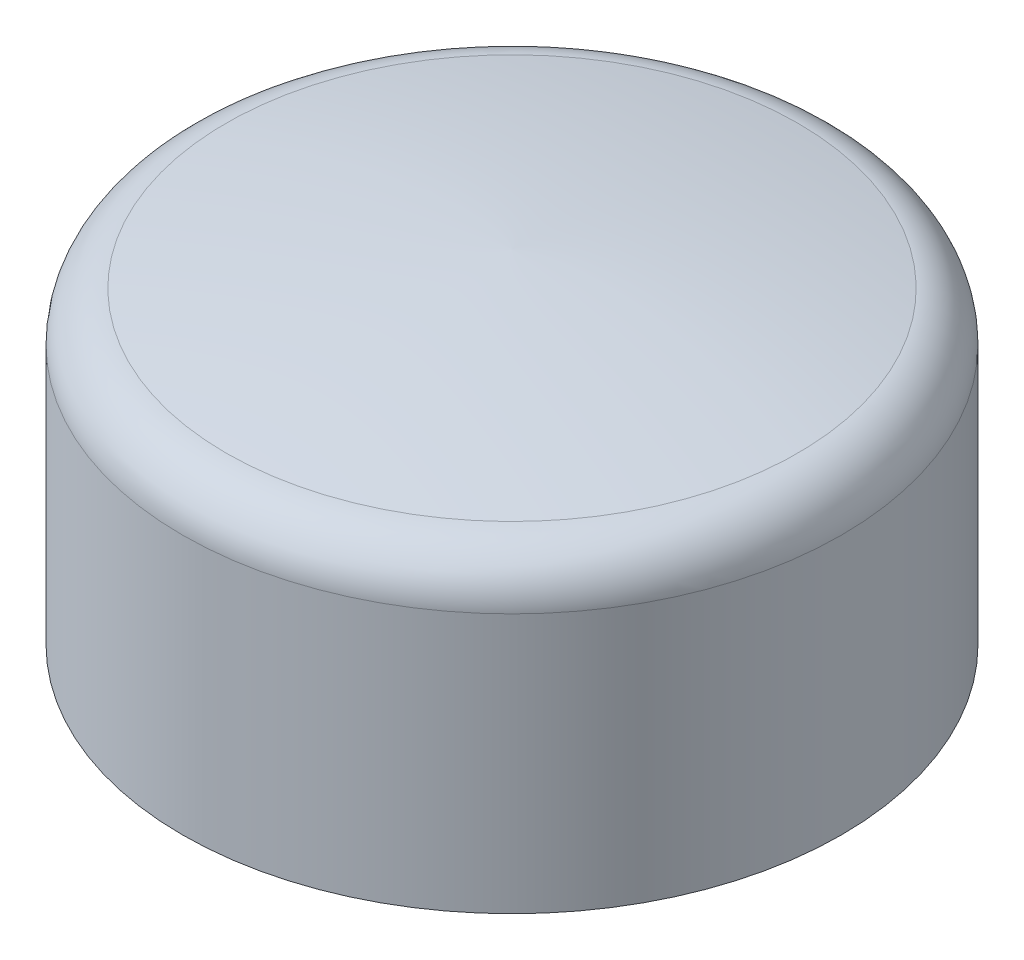
ISO-10303-21;
HEADER;
FILE_DESCRIPTION(('STEP AP214'),'2;1');
FILE_NAME('part.step','',(''),(''),'','','');
FILE_SCHEMA(('AUTOMOTIVE_DESIGN { 1 0 10303 214 1 1 1 1 }'));
ENDSEC;
DATA;
#1=APPLICATION_CONTEXT('core data for automotive mechanical design processes');
#2=APPLICATION_PROTOCOL_DEFINITION('international standard','automotive_design',2000,#1);
#3=PRODUCT_CONTEXT('',#1,'mechanical');
#4=PRODUCT('Part','Part','',(#3));
#5=PRODUCT_RELATED_PRODUCT_CATEGORY('part','',(#4));
#6=PRODUCT_DEFINITION_FORMATION('','',#4);
#7=PRODUCT_DEFINITION_CONTEXT('part definition',#1,'design');
#8=PRODUCT_DEFINITION('design','',#6,#7);
#9=PRODUCT_DEFINITION_SHAPE('','',#8);
#10=(LENGTH_UNIT() NAMED_UNIT(*) SI_UNIT(.MILLI.,.METRE.));
#11=(NAMED_UNIT(*) PLANE_ANGLE_UNIT() SI_UNIT($,.RADIAN.));
#12=(NAMED_UNIT(*) SI_UNIT($,.STERADIAN.) SOLID_ANGLE_UNIT());
#13=UNCERTAINTY_MEASURE_WITH_UNIT(LENGTH_MEASURE(1.E-05),#10,'distance_accuracy_value','');
#14=(GEOMETRIC_REPRESENTATION_CONTEXT(3) GLOBAL_UNCERTAINTY_ASSIGNED_CONTEXT((#13)) GLOBAL_UNIT_ASSIGNED_CONTEXT((#10,
#11,#12)) REPRESENTATION_CONTEXT('',''));
#15=CARTESIAN_POINT('',(0.,0.,0.));
#16=DIRECTION('',(0.,0.,1.));
#17=DIRECTION('',(1.,0.,0.));
#18=AXIS2_PLACEMENT_3D('',#15,#16,#17);
#19=CARTESIAN_POINT('',(0.,-153.412465835068,7.16026189072079));
#20=DIRECTION('',(-1.,0.,0.));
#21=DIRECTION('',(0.,0.,-1.));
#22=AXIS2_PLACEMENT_3D('',#19,#20,#21);
#23=CIRCLE('',#22,185.382872708542);
#24=TRIMMED_CURVE('',#23,(PARAMETER_VALUE(-1.53216253449863)),
(PARAMETER_VALUE(1.53216253449863)),.T.,.PARAMETER.);
#25=CARTESIAN_POINT('',(0.,-153.412465835068,0.));
#26=DIRECTION('',(0.,-1.,0.));
#27=AXIS1_PLACEMENT('',#25,#26);
#28=SURFACE_OF_REVOLUTION('',#24,#27);
#29=CARTESIAN_POINT('',(0.,28.4324915504453,0.));
#30=DIRECTION('',(0.,-1.,0.));
#31=DIRECTION('',(0.,0.,-1.));
#32=AXIS2_PLACEMENT_3D('',#29,#30,#31);
#33=CIRCLE('',#32,28.8844460028456);
#34=CARTESIAN_POINT('',(0.,28.4324915504453,-28.8844460028456));
#35=VERTEX_POINT('',#34);
#36=EDGE_CURVE('E65',#35,#35,#33,.T.);
#37=ORIENTED_EDGE('',*,*,#36,.F.);
#38=EDGE_LOOP('',(#37));
#39=FACE_BOUND('',#38,.T.);
#40=CARTESIAN_POINT('',(0.,31.8320756319559,0.));
#41=VERTEX_POINT('',#40);
#42=VERTEX_LOOP('',#41);
#43=FACE_BOUND('',#42,.T.);
#44=ADVANCED_FACE('F32',(#39,#43),#28,.T.);
#45=CARTESIAN_POINT('',(0.,-153.412465835068,7.16026189072079));
#46=DIRECTION('',(-1.,0.,0.));
#47=DIRECTION('',(0.,0.,-1.));
#48=AXIS2_PLACEMENT_3D('',#45,#46,#47);
#49=CIRCLE('',#48,177.082872708542);
#50=TRIMMED_CURVE('',#49,(PARAMETER_VALUE(-1.53035077533783)),
(PARAMETER_VALUE(1.53035077533783)),.T.,.PARAMETER.);
#51=CARTESIAN_POINT('',(0.,-153.412465835068,0.));
#52=DIRECTION('',(0.,-1.,0.));
#53=AXIS1_PLACEMENT('',#51,#52);
#54=SURFACE_OF_REVOLUTION('',#50,#53);
#55=CARTESIAN_POINT('',(0.,23.5255867606531,0.));
#56=VERTEX_POINT('',#55);
#57=VERTEX_LOOP('',#56);
#58=FACE_BOUND('',#57,.T.);
#59=CARTESIAN_POINT('',(0.,20.7255867606531,0.));
#60=DIRECTION('',(0.,-1.,0.));
#61=DIRECTION('',(0.,0.,-1.));
#62=AXIS2_PLACEMENT_3D('',#59,#60,#61);
#63=CIRCLE('',#62,25.);
#64=CARTESIAN_POINT('',(0.,20.7255867606531,-25.));
#65=VERTEX_POINT('',#64);
#66=EDGE_CURVE('E11',#65,#65,#63,.T.);
#67=ORIENTED_EDGE('',*,*,#66,.T.);
#68=EDGE_LOOP('',(#67));
#69=FACE_BOUND('',#68,.T.);
#70=ADVANCED_FACE('F45',(#58,#69),#54,.F.);
#71=CARTESIAN_POINT('',(0.,0.,0.));
#72=DIRECTION('',(0.,-1.,0.));
#73=DIRECTION('',(0.,0.,-1.));
#74=AXIS2_PLACEMENT_3D('',#71,#72,#73);
#75=CYLINDRICAL_SURFACE('',#74,25.);
#76=ORIENTED_EDGE('',*,*,#66,.F.);
#77=EDGE_LOOP('',(#76));
#78=FACE_BOUND('',#77,.T.);
#79=CARTESIAN_POINT('',(0.,-2.77441323934694,0.));
#80=DIRECTION('',(0.,-1.,0.));
#81=DIRECTION('',(0.,0.,-1.));
#82=AXIS2_PLACEMENT_3D('',#79,#80,#81);
#83=CIRCLE('',#82,25.);
#84=CARTESIAN_POINT('',(0.,-2.77441323934694,-25.));
#85=VERTEX_POINT('',#84);
#86=EDGE_CURVE('E39',#85,#85,#83,.T.);
#87=ORIENTED_EDGE('',*,*,#86,.T.);
#88=EDGE_LOOP('',(#87));
#89=FACE_BOUND('',#88,.T.);
#90=ADVANCED_FACE('F48',(#78,#89),#75,.F.);
#91=CARTESIAN_POINT('',(-33.3,-2.77441323934694,0.));
#92=DIRECTION('',(0.,1.,0.));
#93=DIRECTION('',(0.,0.,1.));
#94=AXIS2_PLACEMENT_3D('',#91,#92,#93);
#95=PLANE('',#94);
#96=ORIENTED_EDGE('',*,*,#86,.F.);
#97=EDGE_LOOP('',(#96));
#98=FACE_BOUND('',#97,.T.);
#99=CARTESIAN_POINT('',(0.,-2.77441323934694,0.));
#100=DIRECTION('',(0.,-1.,0.));
#101=DIRECTION('',(0.,0.,-1.));
#102=AXIS2_PLACEMENT_3D('',#99,#100,#101);
#103=CIRCLE('',#102,33.3);
#104=CARTESIAN_POINT('',(0.,-2.77441323934694,-33.3));
#105=VERTEX_POINT('',#104);
#106=EDGE_CURVE('E58',#105,#105,#103,.T.);
#107=ORIENTED_EDGE('',*,*,#106,.T.);
#108=EDGE_LOOP('',(#107));
#109=FACE_BOUND('',#108,.T.);
#110=ADVANCED_FACE('F53',(#98,#109),#95,.F.);
#111=CARTESIAN_POINT('',(0.,0.,0.));
#112=DIRECTION('',(0.,-1.,0.));
#113=DIRECTION('',(0.,0.,-1.));
#114=AXIS2_PLACEMENT_3D('',#111,#112,#113);
#115=CYLINDRICAL_SURFACE('',#114,33.3);
#116=ORIENTED_EDGE('',*,*,#106,.F.);
#117=EDGE_LOOP('',(#116));
#118=FACE_BOUND('',#117,.T.);
#119=CARTESIAN_POINT('',(0.,23.4667667423475,0.));
#120=DIRECTION('',(0.,-1.,0.));
#121=DIRECTION('',(0.,0.,-1.));
#122=AXIS2_PLACEMENT_3D('',#119,#120,#121);
#123=CIRCLE('',#122,33.3);
#124=CARTESIAN_POINT('',(0.,23.4667667423475,-33.3));
#125=VERTEX_POINT('',#124);
#126=EDGE_CURVE('E60',#125,#125,#123,.T.);
#127=ORIENTED_EDGE('',*,*,#126,.T.);
#128=EDGE_LOOP('',(#127));
#129=FACE_BOUND('',#128,.T.);
#130=ADVANCED_FACE('F88',(#118,#129),#115,.T.);
#131=CARTESIAN_POINT('',(0.,23.4667667423475,0.));
#132=DIRECTION('',(0.,-1.,0.));
#133=DIRECTION('',(0.,0.,-1.));
#134=AXIS2_PLACEMENT_3D('',#131,#132,#133);
#135=TOROIDAL_SURFACE('',#134,28.3,5.);
#136=ORIENTED_EDGE('',*,*,#126,.F.);
#137=EDGE_LOOP('',(#136));
#138=FACE_BOUND('',#137,.T.);
#139=ORIENTED_EDGE('',*,*,#36,.T.);
#140=EDGE_LOOP('',(#139));
#141=FACE_BOUND('',#140,.T.);
#142=ADVANCED_FACE('F69',(#138,#141),#135,.T.);
#143=CLOSED_SHELL('',(#44,#70,#90,#110,#130,#142));
#144=MANIFOLD_SOLID_BREP('B2',#143);
#145=ADVANCED_BREP_SHAPE_REPRESENTATION('',(#18,#144),#14);
#146=SHAPE_DEFINITION_REPRESENTATION(#9,#145);
ENDSEC;
END-ISO-10303-21;
